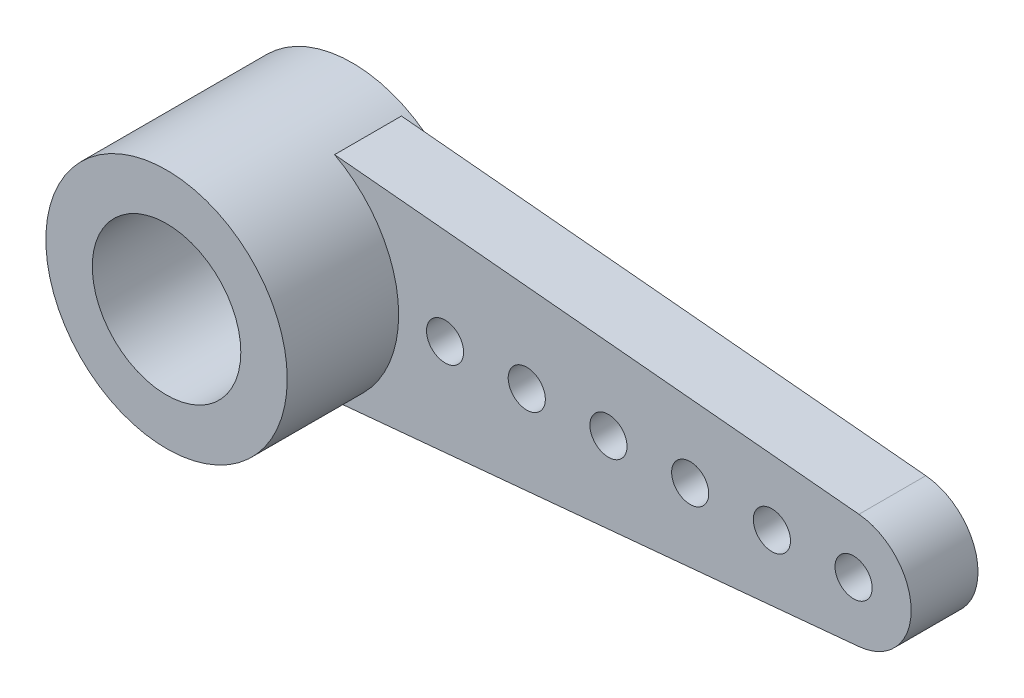
ISO-10303-21;
HEADER;
FILE_DESCRIPTION(('STEP AP214'),'2;1');
FILE_NAME('part.step','',(''),(''),'','','');
FILE_SCHEMA(('AUTOMOTIVE_DESIGN { 1 0 10303 214 1 1 1 1 }'));
ENDSEC;
DATA;
#1=APPLICATION_CONTEXT('core data for automotive mechanical design processes');
#2=APPLICATION_PROTOCOL_DEFINITION('international standard','automotive_design',2000,#1);
#3=PRODUCT_CONTEXT('',#1,'mechanical');
#4=PRODUCT('Part','Part','',(#3));
#5=PRODUCT_RELATED_PRODUCT_CATEGORY('part','',(#4));
#6=PRODUCT_DEFINITION_FORMATION('','',#4);
#7=PRODUCT_DEFINITION_CONTEXT('part definition',#1,'design');
#8=PRODUCT_DEFINITION('design','',#6,#7);
#9=PRODUCT_DEFINITION_SHAPE('','',#8);
#10=(LENGTH_UNIT() NAMED_UNIT(*) SI_UNIT(.MILLI.,.METRE.));
#11=(NAMED_UNIT(*) PLANE_ANGLE_UNIT() SI_UNIT($,.RADIAN.));
#12=(NAMED_UNIT(*) SI_UNIT($,.STERADIAN.) SOLID_ANGLE_UNIT());
#13=UNCERTAINTY_MEASURE_WITH_UNIT(LENGTH_MEASURE(1.E-05),#10,'distance_accuracy_value','');
#14=(GEOMETRIC_REPRESENTATION_CONTEXT(3) GLOBAL_UNCERTAINTY_ASSIGNED_CONTEXT((#13)) GLOBAL_UNIT_ASSIGNED_CONTEXT((#10,
#11,#12)) REPRESENTATION_CONTEXT('',''));
#15=CARTESIAN_POINT('',(0.,0.,0.));
#16=DIRECTION('',(0.,0.,1.));
#17=DIRECTION('',(1.,0.,0.));
#18=AXIS2_PLACEMENT_3D('',#15,#16,#17);
#19=CARTESIAN_POINT('',(1.52516357923835,2.8699087192043,1.8));
#20=DIRECTION('',(0.0935483870967742,0.995614734358422,0.));
#21=DIRECTION('',(-0.995614734358423,0.0935483870967742,0.));
#22=AXIS2_PLACEMENT_3D('',#19,#20,#21);
#23=PLANE('',#22);
#24=DIRECTION('',(0.995614734358422,-0.0935483870967742,0.));
#25=VECTOR('',#24,1.);
#26=CARTESIAN_POINT('',(1.52516357923835,2.8699087192043,0.));
#27=LINE('',#26,#25);
#28=CARTESIAN_POINT('',(1.52516357923835,2.8699087192043,0.));
#29=VERTEX_POINT('',#28);
#30=CARTESIAN_POINT('',(15.645,1.54320283825555,0.));
#31=VERTEX_POINT('',#30);
#32=EDGE_CURVE('E96',#29,#31,#27,.T.);
#33=ORIENTED_EDGE('',*,*,#32,.F.);
#34=DIRECTION('',(0.,0.,-1.));
#35=VECTOR('',#34,1.);
#36=CARTESIAN_POINT('',(1.52516357923835,2.8699087192043,1.8));
#37=LINE('',#36,#35);
#38=CARTESIAN_POINT('',(1.52516357923835,2.8699087192043,1.8));
#39=VERTEX_POINT('',#38);
#40=EDGE_CURVE('E95',#39,#29,#37,.T.);
#41=ORIENTED_EDGE('',*,*,#40,.F.);
#42=DIRECTION('',(0.995614734358422,-0.0935483870967742,0.));
#43=VECTOR('',#42,1.);
#44=CARTESIAN_POINT('',(1.52516357923835,2.8699087192043,1.8));
#45=LINE('',#44,#43);
#46=CARTESIAN_POINT('',(15.645,1.54320283825555,1.8));
#47=VERTEX_POINT('',#46);
#48=EDGE_CURVE('E89',#39,#47,#45,.T.);
#49=ORIENTED_EDGE('',*,*,#48,.T.);
#50=DIRECTION('',(0.,0.,-1.));
#51=VECTOR('',#50,1.);
#52=CARTESIAN_POINT('',(15.645,1.54320283825555,1.8));
#53=LINE('',#52,#51);
#54=EDGE_CURVE('E45',#47,#31,#53,.T.);
#55=ORIENTED_EDGE('',*,*,#54,.T.);
#56=EDGE_LOOP('',(#33,#41,#49,#55));
#57=FACE_BOUND('',#56,.T.);
#58=ADVANCED_FACE('F42',(#57),#23,.T.);
#59=CARTESIAN_POINT('',(0.,0.,1.8));
#60=DIRECTION('',(0.,0.,-1.));
#61=DIRECTION('',(-1.,0.,0.));
#62=AXIS2_PLACEMENT_3D('',#59,#60,#61);
#63=CYLINDRICAL_SURFACE('',#62,3.25);
#64=ORIENTED_EDGE('',*,*,#40,.T.);
#65=CARTESIAN_POINT('',(0.,0.,0.));
#66=DIRECTION('',(0.,0.,1.));
#67=DIRECTION('',(1.,0.,0.));
#68=AXIS2_PLACEMENT_3D('',#65,#66,#67);
#69=CIRCLE('',#68,3.25);
#70=CARTESIAN_POINT('',(1.52516357923835,-2.8699087192043,0.));
#71=VERTEX_POINT('',#70);
#72=EDGE_CURVE('E79',#71,#29,#69,.T.);
#73=ORIENTED_EDGE('',*,*,#72,.F.);
#74=DIRECTION('',(0.,0.,-1.));
#75=VECTOR('',#74,1.);
#76=CARTESIAN_POINT('',(1.52516357923835,-2.8699087192043,1.8));
#77=LINE('',#76,#75);
#78=CARTESIAN_POINT('',(1.52516357923835,-2.8699087192043,1.8));
#79=VERTEX_POINT('',#78);
#80=EDGE_CURVE('E98',#79,#71,#77,.T.);
#81=ORIENTED_EDGE('',*,*,#80,.F.);
#82=CARTESIAN_POINT('',(0.,0.,1.8));
#83=DIRECTION('',(0.,0.,1.));
#84=DIRECTION('',(1.,0.,0.));
#85=AXIS2_PLACEMENT_3D('',#82,#83,#84);
#86=CIRCLE('',#85,3.25);
#87=EDGE_CURVE('E12',#79,#39,#86,.T.);
#88=ORIENTED_EDGE('',*,*,#87,.T.);
#89=EDGE_LOOP('',(#64,#73,#81,#88));
#90=FACE_BOUND('',#89,.T.);
#91=CARTESIAN_POINT('',(0.,0.,-0.2));
#92=DIRECTION('',(0.,0.,1.));
#93=DIRECTION('',(1.,0.,0.));
#94=AXIS2_PLACEMENT_3D('',#91,#92,#93);
#95=CIRCLE('',#94,3.25);
#96=CARTESIAN_POINT('',(3.25,0.,-0.2));
#97=VERTEX_POINT('',#96);
#98=EDGE_CURVE('E112',#97,#97,#95,.T.);
#99=ORIENTED_EDGE('',*,*,#98,.T.);
#100=EDGE_LOOP('',(#99));
#101=FACE_BOUND('',#100,.T.);
#102=CARTESIAN_POINT('',(0.,0.,4.8));
#103=DIRECTION('',(0.,0.,1.));
#104=DIRECTION('',(1.,0.,0.));
#105=AXIS2_PLACEMENT_3D('',#102,#103,#104);
#106=CIRCLE('',#105,3.25);
#107=CARTESIAN_POINT('',(3.25,0.,4.8));
#108=VERTEX_POINT('',#107);
#109=EDGE_CURVE('E261',#108,#108,#106,.T.);
#110=ORIENTED_EDGE('',*,*,#109,.F.);
#111=EDGE_LOOP('',(#110));
#112=FACE_BOUND('',#111,.T.);
#113=ADVANCED_FACE('F100',(#90,#101,#112),#63,.T.);
#114=CARTESIAN_POINT('',(1.52516357923835,-2.8699087192043,1.8));
#115=DIRECTION('',(-0.0935483870967742,0.995614734358422,0.));
#116=DIRECTION('',(-0.995614734358423,-0.0935483870967742,0.));
#117=AXIS2_PLACEMENT_3D('',#114,#115,#116);
#118=PLANE('',#117);
#119=DIRECTION('',(0.995614734358422,0.0935483870967742,0.));
#120=VECTOR('',#119,1.);
#121=CARTESIAN_POINT('',(1.52516357923835,-2.8699087192043,0.));
#122=LINE('',#121,#120);
#123=CARTESIAN_POINT('',(15.645,-1.54320283825555,0.));
#124=VERTEX_POINT('',#123);
#125=EDGE_CURVE('E73',#71,#124,#122,.T.);
#126=ORIENTED_EDGE('',*,*,#125,.T.);
#127=DIRECTION('',(0.,0.,-1.));
#128=VECTOR('',#127,1.);
#129=CARTESIAN_POINT('',(15.645,-1.54320283825555,1.8));
#130=LINE('',#129,#128);
#131=CARTESIAN_POINT('',(15.645,-1.54320283825555,1.8));
#132=VERTEX_POINT('',#131);
#133=EDGE_CURVE('E103',#132,#124,#130,.T.);
#134=ORIENTED_EDGE('',*,*,#133,.F.);
#135=DIRECTION('',(0.995614734358422,0.0935483870967742,0.));
#136=VECTOR('',#135,1.);
#137=CARTESIAN_POINT('',(1.52516357923835,-2.8699087192043,1.8));
#138=LINE('',#137,#136);
#139=EDGE_CURVE('E105',#79,#132,#138,.T.);
#140=ORIENTED_EDGE('',*,*,#139,.F.);
#141=ORIENTED_EDGE('',*,*,#80,.T.);
#142=EDGE_LOOP('',(#126,#134,#140,#141));
#143=FACE_BOUND('',#142,.T.);
#144=ADVANCED_FACE('F106',(#143),#118,.F.);
#145=CARTESIAN_POINT('',(15.5,0.,1.8));
#146=DIRECTION('',(0.,0.,-1.));
#147=DIRECTION('',(-1.,0.,0.));
#148=AXIS2_PLACEMENT_3D('',#145,#146,#147);
#149=CYLINDRICAL_SURFACE('',#148,1.55);
#150=CARTESIAN_POINT('',(15.5,0.,0.));
#151=DIRECTION('',(0.,0.,1.));
#152=DIRECTION('',(1.,0.,0.));
#153=AXIS2_PLACEMENT_3D('',#150,#151,#152);
#154=CIRCLE('',#153,1.55);
#155=EDGE_CURVE('E111',#124,#31,#154,.T.);
#156=ORIENTED_EDGE('',*,*,#155,.T.);
#157=ORIENTED_EDGE('',*,*,#54,.F.);
#158=CARTESIAN_POINT('',(15.5,0.,1.8));
#159=DIRECTION('',(0.,0.,1.));
#160=DIRECTION('',(1.,0.,0.));
#161=AXIS2_PLACEMENT_3D('',#158,#159,#160);
#162=CIRCLE('',#161,1.55);
#163=EDGE_CURVE('E83',#132,#47,#162,.T.);
#164=ORIENTED_EDGE('',*,*,#163,.F.);
#165=ORIENTED_EDGE('',*,*,#133,.T.);
#166=EDGE_LOOP('',(#156,#157,#164,#165));
#167=FACE_BOUND('',#166,.T.);
#168=ADVANCED_FACE('F117',(#167),#149,.T.);
#169=CARTESIAN_POINT('',(15.5,0.,1.8));
#170=DIRECTION('',(0.,0.,1.));
#171=DIRECTION('',(1.,0.,0.));
#172=AXIS2_PLACEMENT_3D('',#169,#170,#171);
#173=PLANE('',#172);
#174=CARTESIAN_POINT('',(15.5,0.,1.8));
#175=DIRECTION('',(0.,0.,1.));
#176=DIRECTION('',(1.,0.,0.));
#177=AXIS2_PLACEMENT_3D('',#174,#175,#176);
#178=CIRCLE('',#177,0.499999999999999);
#179=CARTESIAN_POINT('',(16.,0.,1.8));
#180=VERTEX_POINT('',#179);
#181=EDGE_CURVE('E278',#180,#180,#178,.T.);
#182=ORIENTED_EDGE('',*,*,#181,.F.);
#183=EDGE_LOOP('',(#182));
#184=FACE_BOUND('',#183,.T.);
#185=CARTESIAN_POINT('',(13.3,0.,1.8));
#186=DIRECTION('',(0.,0.,1.));
#187=DIRECTION('',(1.,0.,0.));
#188=AXIS2_PLACEMENT_3D('',#185,#186,#187);
#189=CIRCLE('',#188,0.499999999999999);
#190=CARTESIAN_POINT('',(13.8,0.,1.8));
#191=VERTEX_POINT('',#190);
#192=EDGE_CURVE('E304',#191,#191,#189,.T.);
#193=ORIENTED_EDGE('',*,*,#192,.F.);
#194=EDGE_LOOP('',(#193));
#195=FACE_BOUND('',#194,.T.);
#196=CARTESIAN_POINT('',(11.1,0.,1.8));
#197=DIRECTION('',(0.,0.,1.));
#198=DIRECTION('',(1.,0.,0.));
#199=AXIS2_PLACEMENT_3D('',#196,#197,#198);
#200=CIRCLE('',#199,0.499999999999999);
#201=CARTESIAN_POINT('',(11.6,0.,1.8));
#202=VERTEX_POINT('',#201);
#203=EDGE_CURVE('E298',#202,#202,#200,.T.);
#204=ORIENTED_EDGE('',*,*,#203,.F.);
#205=EDGE_LOOP('',(#204));
#206=FACE_BOUND('',#205,.T.);
#207=CARTESIAN_POINT('',(8.9,0.,1.8));
#208=DIRECTION('',(0.,0.,1.));
#209=DIRECTION('',(1.,0.,0.));
#210=AXIS2_PLACEMENT_3D('',#207,#208,#209);
#211=CIRCLE('',#210,0.499999999999999);
#212=CARTESIAN_POINT('',(9.4,0.,1.8));
#213=VERTEX_POINT('',#212);
#214=EDGE_CURVE('E292',#213,#213,#211,.T.);
#215=ORIENTED_EDGE('',*,*,#214,.F.);
#216=EDGE_LOOP('',(#215));
#217=FACE_BOUND('',#216,.T.);
#218=CARTESIAN_POINT('',(6.7,0.,1.8));
#219=DIRECTION('',(0.,0.,1.));
#220=DIRECTION('',(1.,0.,0.));
#221=AXIS2_PLACEMENT_3D('',#218,#219,#220);
#222=CIRCLE('',#221,0.499999999999999);
#223=CARTESIAN_POINT('',(7.2,0.,1.8));
#224=VERTEX_POINT('',#223);
#225=EDGE_CURVE('E286',#224,#224,#222,.T.);
#226=ORIENTED_EDGE('',*,*,#225,.F.);
#227=EDGE_LOOP('',(#226));
#228=FACE_BOUND('',#227,.T.);
#229=CARTESIAN_POINT('',(4.5,0.,1.8));
#230=DIRECTION('',(0.,0.,1.));
#231=DIRECTION('',(1.,0.,0.));
#232=AXIS2_PLACEMENT_3D('',#229,#230,#231);
#233=CIRCLE('',#232,0.499999999999999);
#234=CARTESIAN_POINT('',(5.,0.,1.8));
#235=VERTEX_POINT('',#234);
#236=EDGE_CURVE('E279',#235,#235,#233,.T.);
#237=ORIENTED_EDGE('',*,*,#236,.F.);
#238=EDGE_LOOP('',(#237));
#239=FACE_BOUND('',#238,.T.);
#240=ORIENTED_EDGE('',*,*,#87,.F.);
#241=ORIENTED_EDGE('',*,*,#139,.T.);
#242=ORIENTED_EDGE('',*,*,#163,.T.);
#243=ORIENTED_EDGE('',*,*,#48,.F.);
#244=EDGE_LOOP('',(#240,#241,#242,#243));
#245=FACE_BOUND('',#244,.T.);
#246=ADVANCED_FACE('F91',(#184,#195,#206,#217,#228,#239,#245),#173,.T.);
#247=CARTESIAN_POINT('',(15.5,0.,0.));
#248=DIRECTION('',(0.,0.,1.));
#249=DIRECTION('',(1.,0.,0.));
#250=AXIS2_PLACEMENT_3D('',#247,#248,#249);
#251=PLANE('',#250);
#252=CARTESIAN_POINT('',(15.5,0.,0.));
#253=DIRECTION('',(0.,0.,1.));
#254=DIRECTION('',(1.,0.,0.));
#255=AXIS2_PLACEMENT_3D('',#252,#253,#254);
#256=CIRCLE('',#255,0.499999999999999);
#257=CARTESIAN_POINT('',(16.,0.,0.));
#258=VERTEX_POINT('',#257);
#259=EDGE_CURVE('E307',#258,#258,#256,.T.);
#260=ORIENTED_EDGE('',*,*,#259,.T.);
#261=EDGE_LOOP('',(#260));
#262=FACE_BOUND('',#261,.T.);
#263=CARTESIAN_POINT('',(13.3,0.,0.));
#264=DIRECTION('',(0.,0.,1.));
#265=DIRECTION('',(1.,0.,0.));
#266=AXIS2_PLACEMENT_3D('',#263,#264,#265);
#267=CIRCLE('',#266,0.499999999999999);
#268=CARTESIAN_POINT('',(13.8,0.,0.));
#269=VERTEX_POINT('',#268);
#270=EDGE_CURVE('E301',#269,#269,#267,.T.);
#271=ORIENTED_EDGE('',*,*,#270,.T.);
#272=EDGE_LOOP('',(#271));
#273=FACE_BOUND('',#272,.T.);
#274=CARTESIAN_POINT('',(11.1,0.,0.));
#275=DIRECTION('',(0.,0.,1.));
#276=DIRECTION('',(1.,0.,0.));
#277=AXIS2_PLACEMENT_3D('',#274,#275,#276);
#278=CIRCLE('',#277,0.499999999999999);
#279=CARTESIAN_POINT('',(11.6,0.,0.));
#280=VERTEX_POINT('',#279);
#281=EDGE_CURVE('E295',#280,#280,#278,.T.);
#282=ORIENTED_EDGE('',*,*,#281,.T.);
#283=EDGE_LOOP('',(#282));
#284=FACE_BOUND('',#283,.T.);
#285=CARTESIAN_POINT('',(8.9,0.,0.));
#286=DIRECTION('',(0.,0.,1.));
#287=DIRECTION('',(1.,0.,0.));
#288=AXIS2_PLACEMENT_3D('',#285,#286,#287);
#289=CIRCLE('',#288,0.499999999999999);
#290=CARTESIAN_POINT('',(9.4,0.,0.));
#291=VERTEX_POINT('',#290);
#292=EDGE_CURVE('E289',#291,#291,#289,.T.);
#293=ORIENTED_EDGE('',*,*,#292,.T.);
#294=EDGE_LOOP('',(#293));
#295=FACE_BOUND('',#294,.T.);
#296=CARTESIAN_POINT('',(6.7,0.,0.));
#297=DIRECTION('',(0.,0.,1.));
#298=DIRECTION('',(1.,0.,0.));
#299=AXIS2_PLACEMENT_3D('',#296,#297,#298);
#300=CIRCLE('',#299,0.499999999999999);
#301=CARTESIAN_POINT('',(7.2,0.,0.));
#302=VERTEX_POINT('',#301);
#303=EDGE_CURVE('E282',#302,#302,#300,.T.);
#304=ORIENTED_EDGE('',*,*,#303,.T.);
#305=EDGE_LOOP('',(#304));
#306=FACE_BOUND('',#305,.T.);
#307=CARTESIAN_POINT('',(4.5,0.,0.));
#308=DIRECTION('',(0.,0.,1.));
#309=DIRECTION('',(1.,0.,0.));
#310=AXIS2_PLACEMENT_3D('',#307,#308,#309);
#311=CIRCLE('',#310,0.499999999999999);
#312=CARTESIAN_POINT('',(5.,0.,0.));
#313=VERTEX_POINT('',#312);
#314=EDGE_CURVE('E283',#313,#313,#311,.T.);
#315=ORIENTED_EDGE('',*,*,#314,.T.);
#316=EDGE_LOOP('',(#315));
#317=FACE_BOUND('',#316,.T.);
#318=ORIENTED_EDGE('',*,*,#125,.F.);
#319=ORIENTED_EDGE('',*,*,#72,.T.);
#320=ORIENTED_EDGE('',*,*,#32,.T.);
#321=ORIENTED_EDGE('',*,*,#155,.F.);
#322=EDGE_LOOP('',(#318,#319,#320,#321));
#323=FACE_BOUND('',#322,.T.);
#324=ADVANCED_FACE('F118',(#262,#273,#284,#295,#306,#317,#323),#251,.F.);
#325=CARTESIAN_POINT('',(0.,0.,-0.2));
#326=DIRECTION('',(0.,0.,1.));
#327=DIRECTION('',(1.,0.,0.));
#328=AXIS2_PLACEMENT_3D('',#325,#326,#327);
#329=PLANE('',#328);
#330=CARTESIAN_POINT('',(0.,0.,-0.2));
#331=DIRECTION('',(0.,0.,1.));
#332=DIRECTION('',(1.,0.,0.));
#333=AXIS2_PLACEMENT_3D('',#330,#331,#332);
#334=CIRCLE('',#333,2.5);
#335=CARTESIAN_POINT('',(2.5,0.,-0.2));
#336=VERTEX_POINT('',#335);
#337=EDGE_CURVE('E251',#336,#336,#334,.T.);
#338=ORIENTED_EDGE('',*,*,#337,.T.);
#339=EDGE_LOOP('',(#338));
#340=FACE_BOUND('',#339,.T.);
#341=ORIENTED_EDGE('',*,*,#98,.F.);
#342=EDGE_LOOP('',(#341));
#343=FACE_BOUND('',#342,.T.);
#344=ADVANCED_FACE('F120',(#340,#343),#329,.F.);
#345=CARTESIAN_POINT('',(0.,0.,-0.2));
#346=DIRECTION('',(0.,0.,1.));
#347=DIRECTION('',(1.,0.,0.));
#348=AXIS2_PLACEMENT_3D('',#345,#346,#347);
#349=CYLINDRICAL_SURFACE('',#348,2.5);
#350=ORIENTED_EDGE('',*,*,#337,.F.);
#351=EDGE_LOOP('',(#350));
#352=FACE_BOUND('',#351,.T.);
#353=CARTESIAN_POINT('',(0.,0.,0.));
#354=DIRECTION('',(0.,0.,1.));
#355=DIRECTION('',(1.,0.,0.));
#356=AXIS2_PLACEMENT_3D('',#353,#354,#355);
#357=CIRCLE('',#356,2.5);
#358=CARTESIAN_POINT('',(2.5,0.,0.));
#359=VERTEX_POINT('',#358);
#360=EDGE_CURVE('E51',#359,#359,#357,.T.);
#361=ORIENTED_EDGE('',*,*,#360,.T.);
#362=EDGE_LOOP('',(#361));
#363=FACE_BOUND('',#362,.T.);
#364=ADVANCED_FACE('F128',(#352,#363),#349,.F.);
#365=CARTESIAN_POINT('',(0.,0.,0.));
#366=DIRECTION('',(0.,0.,1.));
#367=DIRECTION('',(1.,0.,0.));
#368=AXIS2_PLACEMENT_3D('',#365,#366,#367);
#369=CIRCLE('',#368,1.5);
#370=CARTESIAN_POINT('',(1.5,0.,0.));
#371=VERTEX_POINT('',#370);
#372=EDGE_CURVE('E275',#371,#371,#369,.T.);
#373=ORIENTED_EDGE('',*,*,#372,.T.);
#374=EDGE_LOOP('',(#373));
#375=FACE_BOUND('',#374,.T.);
#376=ORIENTED_EDGE('',*,*,#360,.F.);
#377=EDGE_LOOP('',(#376));
#378=FACE_BOUND('',#377,.T.);
#379=ADVANCED_FACE('F123',(#375,#378),#251,.F.);
#380=CARTESIAN_POINT('',(0.,0.,4.8));
#381=DIRECTION('',(0.,0.,1.));
#382=DIRECTION('',(1.,0.,0.));
#383=AXIS2_PLACEMENT_3D('',#380,#381,#382);
#384=PLANE('',#383);
#385=ORIENTED_EDGE('',*,*,#109,.T.);
#386=EDGE_LOOP('',(#385));
#387=FACE_BOUND('',#386,.T.);
#388=CARTESIAN_POINT('',(0.,0.,4.8));
#389=DIRECTION('',(0.,0.,1.));
#390=DIRECTION('',(1.,0.,0.));
#391=AXIS2_PLACEMENT_3D('',#388,#389,#390);
#392=CIRCLE('',#391,2.);
#393=CARTESIAN_POINT('',(2.,0.,4.8));
#394=VERTEX_POINT('',#393);
#395=EDGE_CURVE('E263',#394,#394,#392,.T.);
#396=ORIENTED_EDGE('',*,*,#395,.F.);
#397=EDGE_LOOP('',(#396));
#398=FACE_BOUND('',#397,.T.);
#399=ADVANCED_FACE('F138',(#387,#398),#384,.T.);
#400=CARTESIAN_POINT('',(0.,0.,4.8));
#401=DIRECTION('',(0.,0.,-1.));
#402=DIRECTION('',(-1.,0.,0.));
#403=AXIS2_PLACEMENT_3D('',#400,#401,#402);
#404=CYLINDRICAL_SURFACE('',#403,2.);
#405=ORIENTED_EDGE('',*,*,#395,.T.);
#406=EDGE_LOOP('',(#405));
#407=FACE_BOUND('',#406,.T.);
#408=CARTESIAN_POINT('',(0.,0.,1.8));
#409=DIRECTION('',(0.,0.,1.));
#410=DIRECTION('',(1.,0.,0.));
#411=AXIS2_PLACEMENT_3D('',#408,#409,#410);
#412=CIRCLE('',#411,2.);
#413=CARTESIAN_POINT('',(2.,0.,1.8));
#414=VERTEX_POINT('',#413);
#415=EDGE_CURVE('E267',#414,#414,#412,.T.);
#416=ORIENTED_EDGE('',*,*,#415,.F.);
#417=EDGE_LOOP('',(#416));
#418=FACE_BOUND('',#417,.T.);
#419=ADVANCED_FACE('F237',(#407,#418),#404,.F.);
#420=CARTESIAN_POINT('',(0.,0.,1.8));
#421=DIRECTION('',(0.,0.,1.));
#422=DIRECTION('',(1.,0.,0.));
#423=AXIS2_PLACEMENT_3D('',#420,#421,#422);
#424=CIRCLE('',#423,1.5);
#425=CARTESIAN_POINT('',(1.5,0.,1.8));
#426=VERTEX_POINT('',#425);
#427=EDGE_CURVE('E271',#426,#426,#424,.T.);
#428=ORIENTED_EDGE('',*,*,#427,.F.);
#429=EDGE_LOOP('',(#428));
#430=FACE_BOUND('',#429,.T.);
#431=ORIENTED_EDGE('',*,*,#415,.T.);
#432=EDGE_LOOP('',(#431));
#433=FACE_BOUND('',#432,.T.);
#434=ADVANCED_FACE('F133',(#430,#433),#173,.T.);
#435=CARTESIAN_POINT('',(0.,0.,4.801));
#436=DIRECTION('',(0.,0.,-1.));
#437=DIRECTION('',(-1.,0.,0.));
#438=AXIS2_PLACEMENT_3D('',#435,#436,#437);
#439=CYLINDRICAL_SURFACE('',#438,1.5);
#440=ORIENTED_EDGE('',*,*,#427,.T.);
#441=EDGE_LOOP('',(#440));
#442=FACE_BOUND('',#441,.T.);
#443=ORIENTED_EDGE('',*,*,#372,.F.);
#444=EDGE_LOOP('',(#443));
#445=FACE_BOUND('',#444,.T.);
#446=ADVANCED_FACE('F163',(#442,#445),#439,.F.);
#447=CARTESIAN_POINT('',(4.5,0.,4.801));
#448=DIRECTION('',(0.,0.,-1.));
#449=DIRECTION('',(-1.,0.,0.));
#450=AXIS2_PLACEMENT_3D('',#447,#448,#449);
#451=CYLINDRICAL_SURFACE('',#450,0.499999999999999);
#452=ORIENTED_EDGE('',*,*,#236,.T.);
#453=EDGE_LOOP('',(#452));
#454=FACE_BOUND('',#453,.T.);
#455=ORIENTED_EDGE('',*,*,#314,.F.);
#456=EDGE_LOOP('',(#455));
#457=FACE_BOUND('',#456,.T.);
#458=ADVANCED_FACE('F173',(#454,#457),#451,.F.);
#459=CARTESIAN_POINT('',(6.7,0.,4.801));
#460=DIRECTION('',(0.,0.,-1.));
#461=DIRECTION('',(-1.,0.,0.));
#462=AXIS2_PLACEMENT_3D('',#459,#460,#461);
#463=CYLINDRICAL_SURFACE('',#462,0.499999999999999);
#464=ORIENTED_EDGE('',*,*,#225,.T.);
#465=EDGE_LOOP('',(#464));
#466=FACE_BOUND('',#465,.T.);
#467=ORIENTED_EDGE('',*,*,#303,.F.);
#468=EDGE_LOOP('',(#467));
#469=FACE_BOUND('',#468,.T.);
#470=ADVANCED_FACE('F178',(#466,#469),#463,.F.);
#471=CARTESIAN_POINT('',(8.9,0.,4.801));
#472=DIRECTION('',(0.,0.,-1.));
#473=DIRECTION('',(-1.,0.,0.));
#474=AXIS2_PLACEMENT_3D('',#471,#472,#473);
#475=CYLINDRICAL_SURFACE('',#474,0.499999999999999);
#476=ORIENTED_EDGE('',*,*,#214,.T.);
#477=EDGE_LOOP('',(#476));
#478=FACE_BOUND('',#477,.T.);
#479=ORIENTED_EDGE('',*,*,#292,.F.);
#480=EDGE_LOOP('',(#479));
#481=FACE_BOUND('',#480,.T.);
#482=ADVANCED_FACE('F188',(#478,#481),#475,.F.);
#483=CARTESIAN_POINT('',(11.1,0.,4.801));
#484=DIRECTION('',(0.,0.,-1.));
#485=DIRECTION('',(-1.,0.,0.));
#486=AXIS2_PLACEMENT_3D('',#483,#484,#485);
#487=CYLINDRICAL_SURFACE('',#486,0.499999999999999);
#488=ORIENTED_EDGE('',*,*,#203,.T.);
#489=EDGE_LOOP('',(#488));
#490=FACE_BOUND('',#489,.T.);
#491=ORIENTED_EDGE('',*,*,#281,.F.);
#492=EDGE_LOOP('',(#491));
#493=FACE_BOUND('',#492,.T.);
#494=ADVANCED_FACE('F198',(#490,#493),#487,.F.);
#495=CARTESIAN_POINT('',(13.3,0.,4.801));
#496=DIRECTION('',(0.,0.,-1.));
#497=DIRECTION('',(-1.,0.,0.));
#498=AXIS2_PLACEMENT_3D('',#495,#496,#497);
#499=CYLINDRICAL_SURFACE('',#498,0.499999999999999);
#500=ORIENTED_EDGE('',*,*,#192,.T.);
#501=EDGE_LOOP('',(#500));
#502=FACE_BOUND('',#501,.T.);
#503=ORIENTED_EDGE('',*,*,#270,.F.);
#504=EDGE_LOOP('',(#503));
#505=FACE_BOUND('',#504,.T.);
#506=ADVANCED_FACE('F208',(#502,#505),#499,.F.);
#507=CARTESIAN_POINT('',(15.5,0.,4.801));
#508=DIRECTION('',(0.,0.,-1.));
#509=DIRECTION('',(-1.,0.,0.));
#510=AXIS2_PLACEMENT_3D('',#507,#508,#509);
#511=CYLINDRICAL_SURFACE('',#510,0.499999999999999);
#512=ORIENTED_EDGE('',*,*,#181,.T.);
#513=EDGE_LOOP('',(#512));
#514=FACE_BOUND('',#513,.T.);
#515=ORIENTED_EDGE('',*,*,#259,.F.);
#516=EDGE_LOOP('',(#515));
#517=FACE_BOUND('',#516,.T.);
#518=ADVANCED_FACE('F218',(#514,#517),#511,.F.);
#519=CLOSED_SHELL('',(#58,#113,#144,#168,#246,#324,#344,#364,#379,#399,#419,#434,#446,#458,#470,
#482,#494,#506,#518));
#520=MANIFOLD_SOLID_BREP('B2',#519);
#521=ADVANCED_BREP_SHAPE_REPRESENTATION('',(#18,#520),#14);
#522=SHAPE_DEFINITION_REPRESENTATION(#9,#521);
ENDSEC;
END-ISO-10303-21;
